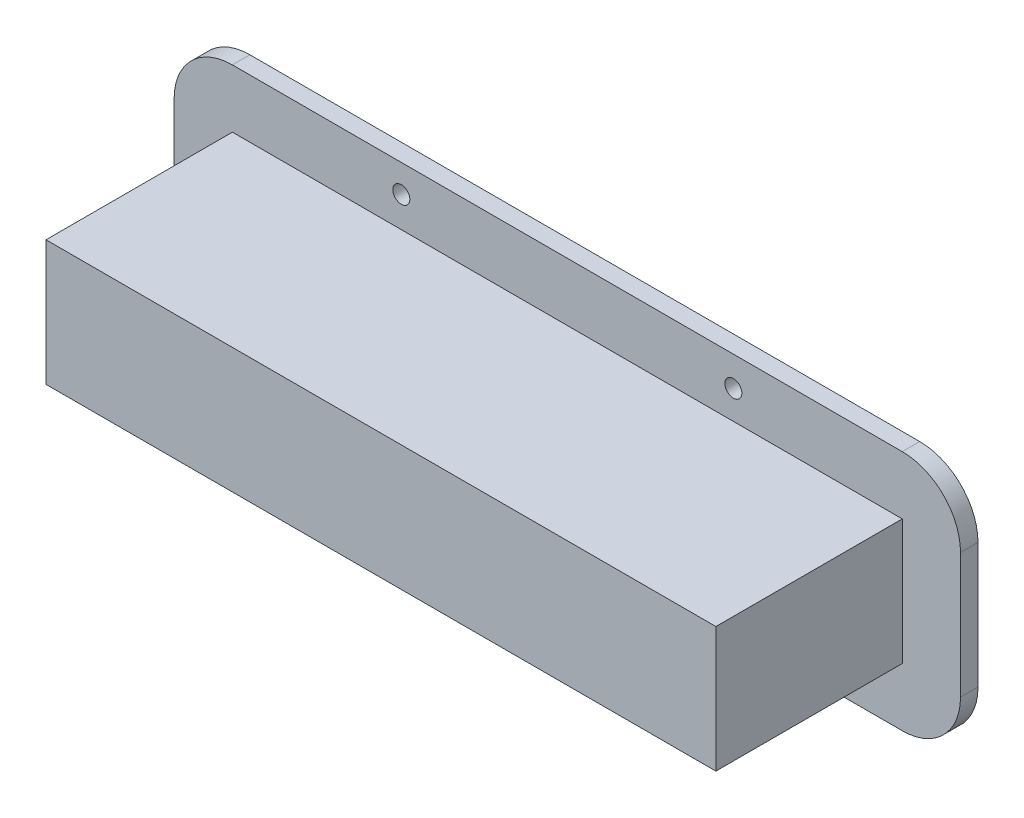
ISO-10303-21;
HEADER;
FILE_DESCRIPTION(('STEP AP214'),'2;1');
FILE_NAME('part.step','',(''),(''),'','','');
FILE_SCHEMA(('AUTOMOTIVE_DESIGN { 1 0 10303 214 1 1 1 1 }'));
ENDSEC;
DATA;
#1=APPLICATION_CONTEXT('core data for automotive mechanical design processes');
#2=APPLICATION_PROTOCOL_DEFINITION('international standard','automotive_design',2000,#1);
#3=PRODUCT_CONTEXT('',#1,'mechanical');
#4=PRODUCT('Part','Part','',(#3));
#5=PRODUCT_RELATED_PRODUCT_CATEGORY('part','',(#4));
#6=PRODUCT_DEFINITION_FORMATION('','',#4);
#7=PRODUCT_DEFINITION_CONTEXT('part definition',#1,'design');
#8=PRODUCT_DEFINITION('design','',#6,#7);
#9=PRODUCT_DEFINITION_SHAPE('','',#8);
#10=(LENGTH_UNIT() NAMED_UNIT(*) SI_UNIT(.MILLI.,.METRE.));
#11=(NAMED_UNIT(*) PLANE_ANGLE_UNIT() SI_UNIT($,.RADIAN.));
#12=(NAMED_UNIT(*) SI_UNIT($,.STERADIAN.) SOLID_ANGLE_UNIT());
#13=UNCERTAINTY_MEASURE_WITH_UNIT(LENGTH_MEASURE(1.E-05),#10,'distance_accuracy_value','');
#14=(GEOMETRIC_REPRESENTATION_CONTEXT(3) GLOBAL_UNCERTAINTY_ASSIGNED_CONTEXT((#13)) GLOBAL_UNIT_ASSIGNED_CONTEXT((#10,
#11,#12)) REPRESENTATION_CONTEXT('',''));
#15=CARTESIAN_POINT('',(0.,0.,0.));
#16=DIRECTION('',(0.,0.,1.));
#17=DIRECTION('',(1.,0.,0.));
#18=AXIS2_PLACEMENT_3D('',#15,#16,#17);
#19=CARTESIAN_POINT('',(0.,0.,0.));
#20=DIRECTION('',(0.,0.,1.));
#21=DIRECTION('',(1.,0.,0.));
#22=AXIS2_PLACEMENT_3D('',#19,#20,#21);
#23=PLANE('',#22);
#24=CARTESIAN_POINT('',(38.2852771272443,-16.6646338797814,0.));
#25=DIRECTION('',(0.,0.,1.));
#26=DIRECTION('',(1.,0.,0.));
#27=AXIS2_PLACEMENT_3D('',#24,#25,#26);
#28=CIRCLE('',#27,1.46);
#29=CARTESIAN_POINT('',(39.7452771272443,-16.6646338797814,0.));
#30=VERTEX_POINT('',#29);
#31=EDGE_CURVE('E185',#30,#30,#28,.T.);
#32=ORIENTED_EDGE('',*,*,#31,.T.);
#33=EDGE_LOOP('',(#32));
#34=FACE_BOUND('',#33,.T.);
#35=CARTESIAN_POINT('',(-18.7147228727557,-16.3426338797814,0.));
#36=DIRECTION('',(0.,0.,1.));
#37=DIRECTION('',(1.,0.,0.));
#38=AXIS2_PLACEMENT_3D('',#35,#36,#37);
#39=CIRCLE('',#38,1.46);
#40=CARTESIAN_POINT('',(-17.2547228727557,-16.3426338797814,0.));
#41=VERTEX_POINT('',#40);
#42=EDGE_CURVE('E188',#41,#41,#39,.T.);
#43=ORIENTED_EDGE('',*,*,#42,.T.);
#44=EDGE_LOOP('',(#43));
#45=FACE_BOUND('',#44,.T.);
#46=CARTESIAN_POINT('',(-18.7147228727557,15.0073661202186,0.));
#47=DIRECTION('',(0.,0.,1.));
#48=DIRECTION('',(1.,0.,0.));
#49=AXIS2_PLACEMENT_3D('',#46,#47,#48);
#50=CIRCLE('',#49,1.46);
#51=CARTESIAN_POINT('',(-17.2547228727557,15.0073661202186,0.));
#52=VERTEX_POINT('',#51);
#53=EDGE_CURVE('E193',#52,#52,#50,.T.);
#54=ORIENTED_EDGE('',*,*,#53,.T.);
#55=EDGE_LOOP('',(#54));
#56=FACE_BOUND('',#55,.T.);
#57=CARTESIAN_POINT('',(38.2852771272443,14.6853661202186,0.));
#58=DIRECTION('',(0.,0.,1.));
#59=DIRECTION('',(1.,0.,0.));
#60=AXIS2_PLACEMENT_3D('',#57,#58,#59);
#61=CIRCLE('',#60,1.46);
#62=CARTESIAN_POINT('',(39.7452771272443,14.6853661202186,0.));
#63=VERTEX_POINT('',#62);
#64=EDGE_CURVE('E196',#63,#63,#61,.T.);
#65=ORIENTED_EDGE('',*,*,#64,.T.);
#66=EDGE_LOOP('',(#65));
#67=FACE_BOUND('',#66,.T.);
#68=CARTESIAN_POINT('',(-47.7147228727557,9.77136612021859,0.));
#69=DIRECTION('',(0.,0.,1.));
#70=DIRECTION('',(1.,0.,0.));
#71=AXIS2_PLACEMENT_3D('',#68,#69,#70);
#72=CIRCLE('',#71,10.);
#73=CARTESIAN_POINT('',(-47.7147228727556,19.7713661202186,0.));
#74=VERTEX_POINT('',#73);
#75=CARTESIAN_POINT('',(-57.7147228727557,9.77136612021852,0.));
#76=VERTEX_POINT('',#75);
#77=EDGE_CURVE('E234',#74,#76,#72,.T.);
#78=ORIENTED_EDGE('',*,*,#77,.F.);
#79=DIRECTION('',(-1.,0.,0.));
#80=VECTOR('',#79,1.);
#81=CARTESIAN_POINT('',(-47.7147228727556,19.7713661202186,0.));
#82=LINE('',#81,#80);
#83=CARTESIAN_POINT('',(67.2852771272443,19.7713661202186,0.));
#84=VERTEX_POINT('',#83);
#85=EDGE_CURVE('E239',#84,#74,#82,.T.);
#86=ORIENTED_EDGE('',*,*,#85,.F.);
#87=CARTESIAN_POINT('',(67.2852771272443,9.77136612021859,0.));
#88=DIRECTION('',(0.,0.,1.));
#89=DIRECTION('',(-1.,0.,0.));
#90=AXIS2_PLACEMENT_3D('',#87,#88,#89);
#91=CIRCLE('',#90,10.);
#92=CARTESIAN_POINT('',(77.2852771272443,9.77136612021852,0.));
#93=VERTEX_POINT('',#92);
#94=EDGE_CURVE('E266',#93,#84,#91,.T.);
#95=ORIENTED_EDGE('',*,*,#94,.F.);
#96=DIRECTION('',(0.,1.,0.));
#97=VECTOR('',#96,1.);
#98=CARTESIAN_POINT('',(77.2852771272443,9.77136612021852,0.));
#99=LINE('',#98,#97);
#100=CARTESIAN_POINT('',(77.2852771272444,-11.7286338797813,0.));
#101=VERTEX_POINT('',#100);
#102=EDGE_CURVE('E264',#101,#93,#99,.T.);
#103=ORIENTED_EDGE('',*,*,#102,.F.);
#104=CARTESIAN_POINT('',(67.2852771272443,-11.7286338797814,0.));
#105=DIRECTION('',(0.,0.,1.));
#106=DIRECTION('',(-1.,0.,0.));
#107=AXIS2_PLACEMENT_3D('',#104,#105,#106);
#108=CIRCLE('',#107,10.);
#109=CARTESIAN_POINT('',(67.2852771272443,-21.7286338797814,0.));
#110=VERTEX_POINT('',#109);
#111=EDGE_CURVE('E262',#110,#101,#108,.T.);
#112=ORIENTED_EDGE('',*,*,#111,.F.);
#113=DIRECTION('',(1.,0.,0.));
#114=VECTOR('',#113,1.);
#115=CARTESIAN_POINT('',(-47.7147228727556,-21.7286338797814,0.));
#116=LINE('',#115,#114);
#117=CARTESIAN_POINT('',(-47.7147228727556,-21.7286338797814,0.));
#118=VERTEX_POINT('',#117);
#119=EDGE_CURVE('E260',#118,#110,#116,.T.);
#120=ORIENTED_EDGE('',*,*,#119,.F.);
#121=CARTESIAN_POINT('',(-47.7147228727557,-11.7286338797814,0.));
#122=DIRECTION('',(0.,0.,1.));
#123=DIRECTION('',(1.,0.,0.));
#124=AXIS2_PLACEMENT_3D('',#121,#122,#123);
#125=CIRCLE('',#124,10.);
#126=CARTESIAN_POINT('',(-57.7147228727557,-11.7286338797813,0.));
#127=VERTEX_POINT('',#126);
#128=EDGE_CURVE('E258',#127,#118,#125,.T.);
#129=ORIENTED_EDGE('',*,*,#128,.F.);
#130=DIRECTION('',(0.,-1.,0.));
#131=VECTOR('',#130,1.);
#132=CARTESIAN_POINT('',(-57.7147228727557,9.77136612021852,0.));
#133=LINE('',#132,#131);
#134=EDGE_CURVE('E256',#76,#127,#133,.T.);
#135=ORIENTED_EDGE('',*,*,#134,.F.);
#136=EDGE_LOOP('',(#78,#86,#95,#103,#112,#120,#129,#135));
#137=FACE_BOUND('',#136,.T.);
#138=DIRECTION('',(0.,1.,0.));
#139=VECTOR('',#138,1.);
#140=CARTESIAN_POINT('',(62.2852771272444,4.77136612021859,0.));
#141=LINE('',#140,#139);
#142=CARTESIAN_POINT('',(62.2852771272444,-6.72863387978141,0.));
#143=VERTEX_POINT('',#142);
#144=CARTESIAN_POINT('',(62.2852771272444,4.77136612021859,0.));
#145=VERTEX_POINT('',#144);
#146=EDGE_CURVE('E213',#143,#145,#141,.T.);
#147=ORIENTED_EDGE('',*,*,#146,.T.);
#148=DIRECTION('',(-1.,0.,0.));
#149=VECTOR('',#148,1.);
#150=CARTESIAN_POINT('',(62.2852771272444,4.77136612021859,0.));
#151=LINE('',#150,#149);
#152=CARTESIAN_POINT('',(-42.7147228727556,4.77136612021858,0.));
#153=VERTEX_POINT('',#152);
#154=EDGE_CURVE('E216',#145,#153,#151,.T.);
#155=ORIENTED_EDGE('',*,*,#154,.T.);
#156=DIRECTION('',(0.,-1.,0.));
#157=VECTOR('',#156,1.);
#158=CARTESIAN_POINT('',(-42.7147228727556,4.77136612021858,0.));
#159=LINE('',#158,#157);
#160=CARTESIAN_POINT('',(-42.7147228727556,-6.72863387978142,0.));
#161=VERTEX_POINT('',#160);
#162=EDGE_CURVE('E220',#153,#161,#159,.T.);
#163=ORIENTED_EDGE('',*,*,#162,.T.);
#164=DIRECTION('',(1.,0.,0.));
#165=VECTOR('',#164,1.);
#166=CARTESIAN_POINT('',(62.2852771272444,-6.72863387978141,0.));
#167=LINE('',#166,#165);
#168=EDGE_CURVE('E206',#161,#143,#167,.T.);
#169=ORIENTED_EDGE('',*,*,#168,.T.);
#170=EDGE_LOOP('',(#147,#155,#163,#169));
#171=FACE_BOUND('',#170,.T.);
#172=ADVANCED_FACE('F33',(#34,#45,#56,#67,#137,#171),#23,.F.);
#173=CARTESIAN_POINT('',(-47.7147228727557,9.77136612021859,35.));
#174=DIRECTION('',(1.,0.,0.));
#175=DIRECTION('',(0.,0.,-1.));
#176=AXIS2_PLACEMENT_3D('',#173,#174,#175);
#177=PLANE('',#176);
#178=DIRECTION('',(0.,0.,-1.));
#179=VECTOR('',#178,1.);
#180=CARTESIAN_POINT('',(-47.7147228727557,-5.22863387978141,35.));
#181=LINE('',#180,#179);
#182=CARTESIAN_POINT('',(-47.7147228727557,-5.22863387978141,26.5));
#183=VERTEX_POINT('',#182);
#184=CARTESIAN_POINT('',(-47.7147228727557,-5.22863387978141,11.5));
#185=VERTEX_POINT('',#184);
#186=EDGE_CURVE('E184',#183,#185,#181,.T.);
#187=ORIENTED_EDGE('',*,*,#186,.T.);
#188=DIRECTION('',(0.,1.,0.));
#189=VECTOR('',#188,1.);
#190=CARTESIAN_POINT('',(-47.7147228727557,9.77136612021859,11.5));
#191=LINE('',#190,#189);
#192=CARTESIAN_POINT('',(-47.7147228727557,3.27136612021859,11.5));
#193=VERTEX_POINT('',#192);
#194=EDGE_CURVE('E177',#185,#193,#191,.T.);
#195=ORIENTED_EDGE('',*,*,#194,.T.);
#196=DIRECTION('',(0.,0.,1.));
#197=VECTOR('',#196,1.);
#198=CARTESIAN_POINT('',(-47.7147228727557,3.27136612021859,35.));
#199=LINE('',#198,#197);
#200=CARTESIAN_POINT('',(-47.7147228727557,3.27136612021859,26.5));
#201=VERTEX_POINT('',#200);
#202=EDGE_CURVE('E166',#193,#201,#199,.T.);
#203=ORIENTED_EDGE('',*,*,#202,.T.);
#204=DIRECTION('',(0.,-1.,0.));
#205=VECTOR('',#204,1.);
#206=CARTESIAN_POINT('',(-47.7147228727557,9.77136612021859,26.5));
#207=LINE('',#206,#205);
#208=EDGE_CURVE('E171',#201,#183,#207,.T.);
#209=ORIENTED_EDGE('',*,*,#208,.T.);
#210=EDGE_LOOP('',(#187,#195,#203,#209));
#211=FACE_BOUND('',#210,.T.);
#212=DIRECTION('',(0.,0.,-1.));
#213=VECTOR('',#212,1.);
#214=CARTESIAN_POINT('',(-47.7147228727557,9.77136612021859,35.));
#215=LINE('',#214,#213);
#216=CARTESIAN_POINT('',(-47.7147228727557,9.77136612021859,35.));
#217=VERTEX_POINT('',#216);
#218=CARTESIAN_POINT('',(-47.7147228727557,9.77136612021859,3.));
#219=VERTEX_POINT('',#218);
#220=EDGE_CURVE('E310',#217,#219,#215,.T.);
#221=ORIENTED_EDGE('',*,*,#220,.T.);
#222=DIRECTION('',(0.,-1.,0.));
#223=VECTOR('',#222,1.);
#224=CARTESIAN_POINT('',(-47.7147228727557,9.77136612021859,3.));
#225=LINE('',#224,#223);
#226=CARTESIAN_POINT('',(-47.7147228727557,-11.7286338797814,3.));
#227=VERTEX_POINT('',#226);
#228=EDGE_CURVE('E298',#219,#227,#225,.T.);
#229=ORIENTED_EDGE('',*,*,#228,.T.);
#230=DIRECTION('',(0.,0.,-1.));
#231=VECTOR('',#230,1.);
#232=CARTESIAN_POINT('',(-47.7147228727557,-11.7286338797814,35.));
#233=LINE('',#232,#231);
#234=CARTESIAN_POINT('',(-47.7147228727557,-11.7286338797814,35.));
#235=VERTEX_POINT('',#234);
#236=EDGE_CURVE('E319',#235,#227,#233,.T.);
#237=ORIENTED_EDGE('',*,*,#236,.F.);
#238=DIRECTION('',(0.,-1.,0.));
#239=VECTOR('',#238,1.);
#240=CARTESIAN_POINT('',(-47.7147228727557,9.77136612021859,35.));
#241=LINE('',#240,#239);
#242=EDGE_CURVE('E301',#217,#235,#241,.T.);
#243=ORIENTED_EDGE('',*,*,#242,.F.);
#244=EDGE_LOOP('',(#221,#229,#237,#243));
#245=FACE_BOUND('',#244,.T.);
#246=ADVANCED_FACE('F35',(#211,#245),#177,.F.);
#247=CARTESIAN_POINT('',(-47.7147228727557,-11.7286338797814,35.));
#248=DIRECTION('',(0.,1.,0.));
#249=DIRECTION('',(0.,0.,1.));
#250=AXIS2_PLACEMENT_3D('',#247,#248,#249);
#251=PLANE('',#250);
#252=ORIENTED_EDGE('',*,*,#236,.T.);
#253=DIRECTION('',(1.,0.,0.));
#254=VECTOR('',#253,1.);
#255=CARTESIAN_POINT('',(-47.7147228727557,-11.7286338797814,3.));
#256=LINE('',#255,#254);
#257=CARTESIAN_POINT('',(67.2852771272443,-11.7286338797814,3.));
#258=VERTEX_POINT('',#257);
#259=EDGE_CURVE('E295',#227,#258,#256,.T.);
#260=ORIENTED_EDGE('',*,*,#259,.T.);
#261=DIRECTION('',(0.,0.,-1.));
#262=VECTOR('',#261,1.);
#263=CARTESIAN_POINT('',(67.2852771272443,-11.7286338797814,35.));
#264=LINE('',#263,#262);
#265=CARTESIAN_POINT('',(67.2852771272443,-11.7286338797814,35.));
#266=VERTEX_POINT('',#265);
#267=EDGE_CURVE('E316',#266,#258,#264,.T.);
#268=ORIENTED_EDGE('',*,*,#267,.F.);
#269=DIRECTION('',(1.,0.,0.));
#270=VECTOR('',#269,1.);
#271=CARTESIAN_POINT('',(-47.7147228727557,-11.7286338797814,35.));
#272=LINE('',#271,#270);
#273=EDGE_CURVE('E304',#235,#266,#272,.T.);
#274=ORIENTED_EDGE('',*,*,#273,.F.);
#275=EDGE_LOOP('',(#252,#260,#268,#274));
#276=FACE_BOUND('',#275,.T.);
#277=ADVANCED_FACE('F367',(#276),#251,.F.);
#278=CARTESIAN_POINT('',(67.2852771272443,9.77136612021859,35.));
#279=DIRECTION('',(-1.,0.,0.));
#280=DIRECTION('',(0.,0.,1.));
#281=AXIS2_PLACEMENT_3D('',#278,#279,#280);
#282=PLANE('',#281);
#283=ORIENTED_EDGE('',*,*,#267,.T.);
#284=DIRECTION('',(0.,1.,0.));
#285=VECTOR('',#284,1.);
#286=CARTESIAN_POINT('',(67.2852771272443,9.77136612021859,3.));
#287=LINE('',#286,#285);
#288=CARTESIAN_POINT('',(67.2852771272443,9.77136612021859,3.));
#289=VERTEX_POINT('',#288);
#290=EDGE_CURVE('E292',#258,#289,#287,.T.);
#291=ORIENTED_EDGE('',*,*,#290,.T.);
#292=DIRECTION('',(0.,0.,-1.));
#293=VECTOR('',#292,1.);
#294=CARTESIAN_POINT('',(67.2852771272443,9.77136612021859,35.));
#295=LINE('',#294,#293);
#296=CARTESIAN_POINT('',(67.2852771272443,9.77136612021859,35.));
#297=VERTEX_POINT('',#296);
#298=EDGE_CURVE('E313',#297,#289,#295,.T.);
#299=ORIENTED_EDGE('',*,*,#298,.F.);
#300=DIRECTION('',(0.,1.,0.));
#301=VECTOR('',#300,1.);
#302=CARTESIAN_POINT('',(67.2852771272443,9.77136612021859,35.));
#303=LINE('',#302,#301);
#304=EDGE_CURVE('E306',#266,#297,#303,.T.);
#305=ORIENTED_EDGE('',*,*,#304,.F.);
#306=EDGE_LOOP('',(#283,#291,#299,#305));
#307=FACE_BOUND('',#306,.T.);
#308=ADVANCED_FACE('F376',(#307),#282,.F.);
#309=CARTESIAN_POINT('',(-47.7147228727557,9.77136612021859,35.));
#310=DIRECTION('',(0.,-1.,0.));
#311=DIRECTION('',(0.,0.,-1.));
#312=AXIS2_PLACEMENT_3D('',#309,#310,#311);
#313=PLANE('',#312);
#314=ORIENTED_EDGE('',*,*,#298,.T.);
#315=DIRECTION('',(-1.,0.,0.));
#316=VECTOR('',#315,1.);
#317=CARTESIAN_POINT('',(-47.7147228727557,9.77136612021859,3.));
#318=LINE('',#317,#316);
#319=EDGE_CURVE('E322',#289,#219,#318,.T.);
#320=ORIENTED_EDGE('',*,*,#319,.T.);
#321=ORIENTED_EDGE('',*,*,#220,.F.);
#322=DIRECTION('',(-1.,0.,0.));
#323=VECTOR('',#322,1.);
#324=CARTESIAN_POINT('',(-47.7147228727557,9.77136612021859,35.));
#325=LINE('',#324,#323);
#326=EDGE_CURVE('E308',#297,#217,#325,.T.);
#327=ORIENTED_EDGE('',*,*,#326,.F.);
#328=EDGE_LOOP('',(#314,#320,#321,#327));
#329=FACE_BOUND('',#328,.T.);
#330=ADVANCED_FACE('F373',(#329),#313,.F.);
#331=CARTESIAN_POINT('',(0.,0.,35.));
#332=DIRECTION('',(0.,0.,1.));
#333=DIRECTION('',(1.,0.,0.));
#334=AXIS2_PLACEMENT_3D('',#331,#332,#333);
#335=PLANE('',#334);
#336=ORIENTED_EDGE('',*,*,#242,.T.);
#337=ORIENTED_EDGE('',*,*,#273,.T.);
#338=ORIENTED_EDGE('',*,*,#304,.T.);
#339=ORIENTED_EDGE('',*,*,#326,.T.);
#340=EDGE_LOOP('',(#336,#337,#338,#339));
#341=FACE_BOUND('',#340,.T.);
#342=ADVANCED_FACE('F371',(#341),#335,.T.);
#343=CARTESIAN_POINT('',(-47.7147228727557,9.77136612021859,3.));
#344=DIRECTION('',(0.,0.,1.));
#345=DIRECTION('',(1.,0.,0.));
#346=AXIS2_PLACEMENT_3D('',#343,#344,#345);
#347=PLANE('',#346);
#348=CARTESIAN_POINT('',(38.2852771272443,-16.6646338797814,3.));
#349=DIRECTION('',(0.,0.,1.));
#350=DIRECTION('',(1.,0.,0.));
#351=AXIS2_PLACEMENT_3D('',#348,#349,#350);
#352=CIRCLE('',#351,1.46);
#353=CARTESIAN_POINT('',(39.7452771272443,-16.6646338797814,3.));
#354=VERTEX_POINT('',#353);
#355=EDGE_CURVE('E217',#354,#354,#352,.F.);
#356=ORIENTED_EDGE('',*,*,#355,.T.);
#357=EDGE_LOOP('',(#356));
#358=FACE_BOUND('',#357,.T.);
#359=CARTESIAN_POINT('',(-18.7147228727557,-16.3426338797814,3.));
#360=DIRECTION('',(0.,0.,1.));
#361=DIRECTION('',(1.,0.,0.));
#362=AXIS2_PLACEMENT_3D('',#359,#360,#361);
#363=CIRCLE('',#362,1.46);
#364=CARTESIAN_POINT('',(-17.2547228727557,-16.3426338797814,3.));
#365=VERTEX_POINT('',#364);
#366=EDGE_CURVE('E331',#365,#365,#363,.F.);
#367=ORIENTED_EDGE('',*,*,#366,.T.);
#368=EDGE_LOOP('',(#367));
#369=FACE_BOUND('',#368,.T.);
#370=CARTESIAN_POINT('',(-18.7147228727557,15.0073661202186,3.));
#371=DIRECTION('',(0.,0.,1.));
#372=DIRECTION('',(1.,0.,0.));
#373=AXIS2_PLACEMENT_3D('',#370,#371,#372);
#374=CIRCLE('',#373,1.46);
#375=CARTESIAN_POINT('',(-17.2547228727557,15.0073661202186,3.));
#376=VERTEX_POINT('',#375);
#377=EDGE_CURVE('E328',#376,#376,#374,.F.);
#378=ORIENTED_EDGE('',*,*,#377,.T.);
#379=EDGE_LOOP('',(#378));
#380=FACE_BOUND('',#379,.T.);
#381=CARTESIAN_POINT('',(38.2852771272443,14.6853661202186,3.));
#382=DIRECTION('',(0.,0.,1.));
#383=DIRECTION('',(1.,0.,0.));
#384=AXIS2_PLACEMENT_3D('',#381,#382,#383);
#385=CIRCLE('',#384,1.46);
#386=CARTESIAN_POINT('',(39.7452771272443,14.6853661202186,3.));
#387=VERTEX_POINT('',#386);
#388=EDGE_CURVE('E201',#387,#387,#385,.F.);
#389=ORIENTED_EDGE('',*,*,#388,.T.);
#390=EDGE_LOOP('',(#389));
#391=FACE_BOUND('',#390,.T.);
#392=CARTESIAN_POINT('',(-47.7147228727557,9.77136612021859,3.));
#393=DIRECTION('',(0.,0.,1.));
#394=DIRECTION('',(1.,0.,0.));
#395=AXIS2_PLACEMENT_3D('',#392,#393,#394);
#396=CIRCLE('',#395,10.);
#397=CARTESIAN_POINT('',(-47.7147228727556,19.7713661202186,3.));
#398=VERTEX_POINT('',#397);
#399=CARTESIAN_POINT('',(-57.7147228727557,9.77136612021852,3.));
#400=VERTEX_POINT('',#399);
#401=EDGE_CURVE('E235',#398,#400,#396,.T.);
#402=ORIENTED_EDGE('',*,*,#401,.T.);
#403=DIRECTION('',(0.,-1.,0.));
#404=VECTOR('',#403,1.);
#405=CARTESIAN_POINT('',(-57.7147228727557,9.77136612021852,3.));
#406=LINE('',#405,#404);
#407=CARTESIAN_POINT('',(-57.7147228727557,-11.7286338797813,3.));
#408=VERTEX_POINT('',#407);
#409=EDGE_CURVE('E238',#400,#408,#406,.T.);
#410=ORIENTED_EDGE('',*,*,#409,.T.);
#411=CARTESIAN_POINT('',(-47.7147228727557,-11.7286338797814,3.));
#412=DIRECTION('',(0.,0.,1.));
#413=DIRECTION('',(1.,0.,0.));
#414=AXIS2_PLACEMENT_3D('',#411,#412,#413);
#415=CIRCLE('',#414,10.);
#416=CARTESIAN_POINT('',(-47.7147228727556,-21.7286338797814,3.));
#417=VERTEX_POINT('',#416);
#418=EDGE_CURVE('E241',#408,#417,#415,.T.);
#419=ORIENTED_EDGE('',*,*,#418,.T.);
#420=DIRECTION('',(1.,0.,0.));
#421=VECTOR('',#420,1.);
#422=CARTESIAN_POINT('',(-47.7147228727556,-21.7286338797814,3.));
#423=LINE('',#422,#421);
#424=CARTESIAN_POINT('',(67.2852771272443,-21.7286338797814,3.));
#425=VERTEX_POINT('',#424);
#426=EDGE_CURVE('E243',#417,#425,#423,.T.);
#427=ORIENTED_EDGE('',*,*,#426,.T.);
#428=CARTESIAN_POINT('',(67.2852771272443,-11.7286338797814,3.));
#429=DIRECTION('',(0.,0.,1.));
#430=DIRECTION('',(-1.,0.,0.));
#431=AXIS2_PLACEMENT_3D('',#428,#429,#430);
#432=CIRCLE('',#431,10.);
#433=CARTESIAN_POINT('',(77.2852771272444,-11.7286338797813,3.));
#434=VERTEX_POINT('',#433);
#435=EDGE_CURVE('E245',#425,#434,#432,.T.);
#436=ORIENTED_EDGE('',*,*,#435,.T.);
#437=DIRECTION('',(0.,1.,0.));
#438=VECTOR('',#437,1.);
#439=CARTESIAN_POINT('',(77.2852771272443,9.77136612021852,3.));
#440=LINE('',#439,#438);
#441=CARTESIAN_POINT('',(77.2852771272443,9.77136612021852,3.));
#442=VERTEX_POINT('',#441);
#443=EDGE_CURVE('E247',#434,#442,#440,.T.);
#444=ORIENTED_EDGE('',*,*,#443,.T.);
#445=CARTESIAN_POINT('',(67.2852771272443,9.77136612021859,3.));
#446=DIRECTION('',(0.,0.,1.));
#447=DIRECTION('',(-1.,0.,0.));
#448=AXIS2_PLACEMENT_3D('',#445,#446,#447);
#449=CIRCLE('',#448,10.);
#450=CARTESIAN_POINT('',(67.2852771272443,19.7713661202186,3.));
#451=VERTEX_POINT('',#450);
#452=EDGE_CURVE('E249',#442,#451,#449,.T.);
#453=ORIENTED_EDGE('',*,*,#452,.T.);
#454=DIRECTION('',(-1.,0.,0.));
#455=VECTOR('',#454,1.);
#456=CARTESIAN_POINT('',(-47.7147228727556,19.7713661202186,3.));
#457=LINE('',#456,#455);
#458=EDGE_CURVE('E251',#451,#398,#457,.T.);
#459=ORIENTED_EDGE('',*,*,#458,.T.);
#460=EDGE_LOOP('',(#402,#410,#419,#427,#436,#444,#453,#459));
#461=FACE_BOUND('',#460,.T.);
#462=ORIENTED_EDGE('',*,*,#228,.F.);
#463=ORIENTED_EDGE('',*,*,#319,.F.);
#464=ORIENTED_EDGE('',*,*,#290,.F.);
#465=ORIENTED_EDGE('',*,*,#259,.F.);
#466=EDGE_LOOP('',(#462,#463,#464,#465));
#467=FACE_BOUND('',#466,.T.);
#468=ADVANCED_FACE('F389',(#358,#369,#380,#391,#461,#467),#347,.T.);
#469=CARTESIAN_POINT('',(-47.7147228727557,9.77136612021859,3.));
#470=DIRECTION('',(0.,0.,-1.));
#471=DIRECTION('',(-1.,0.,0.));
#472=AXIS2_PLACEMENT_3D('',#469,#470,#471);
#473=CYLINDRICAL_SURFACE('',#472,10.);
#474=ORIENTED_EDGE('',*,*,#77,.T.);
#475=DIRECTION('',(0.,0.,-1.));
#476=VECTOR('',#475,1.);
#477=CARTESIAN_POINT('',(-57.7147228727557,9.77136612021852,3.));
#478=LINE('',#477,#476);
#479=EDGE_CURVE('E289',#400,#76,#478,.T.);
#480=ORIENTED_EDGE('',*,*,#479,.F.);
#481=ORIENTED_EDGE('',*,*,#401,.F.);
#482=DIRECTION('',(0.,0.,-1.));
#483=VECTOR('',#482,1.);
#484=CARTESIAN_POINT('',(-47.7147228727556,19.7713661202186,3.));
#485=LINE('',#484,#483);
#486=EDGE_CURVE('E253',#398,#74,#485,.T.);
#487=ORIENTED_EDGE('',*,*,#486,.T.);
#488=EDGE_LOOP('',(#474,#480,#481,#487));
#489=FACE_BOUND('',#488,.T.);
#490=ADVANCED_FACE('F398',(#489),#473,.T.);
#491=CARTESIAN_POINT('',(-57.7147228727557,9.77136612021852,3.));
#492=DIRECTION('',(1.,0.,0.));
#493=DIRECTION('',(0.,1.,0.));
#494=AXIS2_PLACEMENT_3D('',#491,#492,#493);
#495=PLANE('',#494);
#496=ORIENTED_EDGE('',*,*,#134,.T.);
#497=DIRECTION('',(0.,0.,-1.));
#498=VECTOR('',#497,1.);
#499=CARTESIAN_POINT('',(-57.7147228727557,-11.7286338797813,3.));
#500=LINE('',#499,#498);
#501=EDGE_CURVE('E286',#408,#127,#500,.T.);
#502=ORIENTED_EDGE('',*,*,#501,.F.);
#503=ORIENTED_EDGE('',*,*,#409,.F.);
#504=ORIENTED_EDGE('',*,*,#479,.T.);
#505=EDGE_LOOP('',(#496,#502,#503,#504));
#506=FACE_BOUND('',#505,.T.);
#507=ADVANCED_FACE('F404',(#506),#495,.F.);
#508=CARTESIAN_POINT('',(-47.7147228727557,-11.7286338797814,3.));
#509=DIRECTION('',(0.,0.,-1.));
#510=DIRECTION('',(-1.,0.,0.));
#511=AXIS2_PLACEMENT_3D('',#508,#509,#510);
#512=CYLINDRICAL_SURFACE('',#511,10.);
#513=ORIENTED_EDGE('',*,*,#128,.T.);
#514=DIRECTION('',(0.,0.,-1.));
#515=VECTOR('',#514,1.);
#516=CARTESIAN_POINT('',(-47.7147228727556,-21.7286338797814,3.));
#517=LINE('',#516,#515);
#518=EDGE_CURVE('E283',#417,#118,#517,.T.);
#519=ORIENTED_EDGE('',*,*,#518,.F.);
#520=ORIENTED_EDGE('',*,*,#418,.F.);
#521=ORIENTED_EDGE('',*,*,#501,.T.);
#522=EDGE_LOOP('',(#513,#519,#520,#521));
#523=FACE_BOUND('',#522,.T.);
#524=ADVANCED_FACE('F430',(#523),#512,.T.);
#525=CARTESIAN_POINT('',(-47.7147228727556,-21.7286338797814,3.));
#526=DIRECTION('',(0.,1.,0.));
#527=DIRECTION('',(0.,0.,1.));
#528=AXIS2_PLACEMENT_3D('',#525,#526,#527);
#529=PLANE('',#528);
#530=ORIENTED_EDGE('',*,*,#119,.T.);
#531=DIRECTION('',(0.,0.,-1.));
#532=VECTOR('',#531,1.);
#533=CARTESIAN_POINT('',(67.2852771272443,-21.7286338797814,3.));
#534=LINE('',#533,#532);
#535=EDGE_CURVE('E280',#425,#110,#534,.T.);
#536=ORIENTED_EDGE('',*,*,#535,.F.);
#537=ORIENTED_EDGE('',*,*,#426,.F.);
#538=ORIENTED_EDGE('',*,*,#518,.T.);
#539=EDGE_LOOP('',(#530,#536,#537,#538));
#540=FACE_BOUND('',#539,.T.);
#541=ADVANCED_FACE('F426',(#540),#529,.F.);
#542=CARTESIAN_POINT('',(67.2852771272443,-11.7286338797814,3.));
#543=DIRECTION('',(0.,0.,-1.));
#544=DIRECTION('',(-1.,0.,0.));
#545=AXIS2_PLACEMENT_3D('',#542,#543,#544);
#546=CYLINDRICAL_SURFACE('',#545,10.);
#547=ORIENTED_EDGE('',*,*,#111,.T.);
#548=DIRECTION('',(0.,0.,-1.));
#549=VECTOR('',#548,1.);
#550=CARTESIAN_POINT('',(77.2852771272444,-11.7286338797813,3.));
#551=LINE('',#550,#549);
#552=EDGE_CURVE('E277',#434,#101,#551,.T.);
#553=ORIENTED_EDGE('',*,*,#552,.F.);
#554=ORIENTED_EDGE('',*,*,#435,.F.);
#555=ORIENTED_EDGE('',*,*,#535,.T.);
#556=EDGE_LOOP('',(#547,#553,#554,#555));
#557=FACE_BOUND('',#556,.T.);
#558=ADVANCED_FACE('F422',(#557),#546,.T.);
#559=CARTESIAN_POINT('',(77.2852771272443,9.77136612021852,3.));
#560=DIRECTION('',(-1.,0.,0.));
#561=DIRECTION('',(0.,-1.,0.));
#562=AXIS2_PLACEMENT_3D('',#559,#560,#561);
#563=PLANE('',#562);
#564=ORIENTED_EDGE('',*,*,#102,.T.);
#565=DIRECTION('',(0.,0.,-1.));
#566=VECTOR('',#565,1.);
#567=CARTESIAN_POINT('',(77.2852771272443,9.77136612021852,3.));
#568=LINE('',#567,#566);
#569=EDGE_CURVE('E274',#442,#93,#568,.T.);
#570=ORIENTED_EDGE('',*,*,#569,.F.);
#571=ORIENTED_EDGE('',*,*,#443,.F.);
#572=ORIENTED_EDGE('',*,*,#552,.T.);
#573=EDGE_LOOP('',(#564,#570,#571,#572));
#574=FACE_BOUND('',#573,.T.);
#575=ADVANCED_FACE('F418',(#574),#563,.F.);
#576=CARTESIAN_POINT('',(67.2852771272443,9.77136612021859,3.));
#577=DIRECTION('',(0.,0.,-1.));
#578=DIRECTION('',(-1.,0.,0.));
#579=AXIS2_PLACEMENT_3D('',#576,#577,#578);
#580=CYLINDRICAL_SURFACE('',#579,10.);
#581=ORIENTED_EDGE('',*,*,#94,.T.);
#582=DIRECTION('',(0.,0.,-1.));
#583=VECTOR('',#582,1.);
#584=CARTESIAN_POINT('',(67.2852771272443,19.7713661202186,3.));
#585=LINE('',#584,#583);
#586=EDGE_CURVE('E271',#451,#84,#585,.T.);
#587=ORIENTED_EDGE('',*,*,#586,.F.);
#588=ORIENTED_EDGE('',*,*,#452,.F.);
#589=ORIENTED_EDGE('',*,*,#569,.T.);
#590=EDGE_LOOP('',(#581,#587,#588,#589));
#591=FACE_BOUND('',#590,.T.);
#592=ADVANCED_FACE('F414',(#591),#580,.T.);
#593=CARTESIAN_POINT('',(-47.7147228727556,19.7713661202186,3.));
#594=DIRECTION('',(0.,-1.,0.));
#595=DIRECTION('',(0.,0.,-1.));
#596=AXIS2_PLACEMENT_3D('',#593,#594,#595);
#597=PLANE('',#596);
#598=ORIENTED_EDGE('',*,*,#85,.T.);
#599=ORIENTED_EDGE('',*,*,#486,.F.);
#600=ORIENTED_EDGE('',*,*,#458,.F.);
#601=ORIENTED_EDGE('',*,*,#586,.T.);
#602=EDGE_LOOP('',(#598,#599,#600,#601));
#603=FACE_BOUND('',#602,.T.);
#604=ADVANCED_FACE('F411',(#603),#597,.F.);
#605=CARTESIAN_POINT('',(62.2852771272444,4.77136612021859,30.));
#606=DIRECTION('',(-1.,0.,0.));
#607=DIRECTION('',(0.,0.,1.));
#608=AXIS2_PLACEMENT_3D('',#605,#606,#607);
#609=PLANE('',#608);
#610=ORIENTED_EDGE('',*,*,#146,.F.);
#611=DIRECTION('',(0.,0.,-1.));
#612=VECTOR('',#611,1.);
#613=CARTESIAN_POINT('',(62.2852771272444,-6.72863387978141,30.));
#614=LINE('',#613,#612);
#615=CARTESIAN_POINT('',(62.2852771272444,-6.72863387978141,30.));
#616=VERTEX_POINT('',#615);
#617=EDGE_CURVE('E212',#616,#143,#614,.T.);
#618=ORIENTED_EDGE('',*,*,#617,.F.);
#619=DIRECTION('',(0.,1.,0.));
#620=VECTOR('',#619,1.);
#621=CARTESIAN_POINT('',(62.2852771272444,4.77136612021859,30.));
#622=LINE('',#621,#620);
#623=CARTESIAN_POINT('',(62.2852771272444,4.77136612021859,30.));
#624=VERTEX_POINT('',#623);
#625=EDGE_CURVE('E202',#616,#624,#622,.T.);
#626=ORIENTED_EDGE('',*,*,#625,.T.);
#627=DIRECTION('',(0.,0.,-1.));
#628=VECTOR('',#627,1.);
#629=CARTESIAN_POINT('',(62.2852771272444,4.77136612021859,30.));
#630=LINE('',#629,#628);
#631=EDGE_CURVE('E231',#624,#145,#630,.T.);
#632=ORIENTED_EDGE('',*,*,#631,.T.);
#633=EDGE_LOOP('',(#610,#618,#626,#632));
#634=FACE_BOUND('',#633,.T.);
#635=ADVANCED_FACE('F409',(#634),#609,.T.);
#636=CARTESIAN_POINT('',(62.2852771272444,4.77136612021859,30.));
#637=DIRECTION('',(0.,-1.,0.));
#638=DIRECTION('',(1.,0.,0.));
#639=AXIS2_PLACEMENT_3D('',#636,#637,#638);
#640=PLANE('',#639);
#641=ORIENTED_EDGE('',*,*,#154,.F.);
#642=ORIENTED_EDGE('',*,*,#631,.F.);
#643=DIRECTION('',(-1.,0.,0.));
#644=VECTOR('',#643,1.);
#645=CARTESIAN_POINT('',(62.2852771272444,4.77136612021859,30.));
#646=LINE('',#645,#644);
#647=CARTESIAN_POINT('',(-42.7147228727556,4.77136612021858,30.));
#648=VERTEX_POINT('',#647);
#649=EDGE_CURVE('E205',#624,#648,#646,.T.);
#650=ORIENTED_EDGE('',*,*,#649,.T.);
#651=DIRECTION('',(0.,0.,-1.));
#652=VECTOR('',#651,1.);
#653=CARTESIAN_POINT('',(-42.7147228727556,4.77136612021858,30.));
#654=LINE('',#653,#652);
#655=EDGE_CURVE('E229',#648,#153,#654,.T.);
#656=ORIENTED_EDGE('',*,*,#655,.T.);
#657=EDGE_LOOP('',(#641,#642,#650,#656));
#658=FACE_BOUND('',#657,.T.);
#659=ADVANCED_FACE('F477',(#658),#640,.T.);
#660=CARTESIAN_POINT('',(-42.7147228727556,4.77136612021858,30.));
#661=DIRECTION('',(1.,0.,0.));
#662=DIRECTION('',(0.,0.,-1.));
#663=AXIS2_PLACEMENT_3D('',#660,#661,#662);
#664=PLANE('',#663);
#665=DIRECTION('',(0.,1.,0.));
#666=VECTOR('',#665,1.);
#667=CARTESIAN_POINT('',(-42.7147228727556,4.77136612021858,11.5));
#668=LINE('',#667,#666);
#669=CARTESIAN_POINT('',(-42.7147228727556,-5.22863387978141,11.5));
#670=VERTEX_POINT('',#669);
#671=CARTESIAN_POINT('',(-42.7147228727556,3.27136612021859,11.5));
#672=VERTEX_POINT('',#671);
#673=EDGE_CURVE('E11',#670,#672,#668,.T.);
#674=ORIENTED_EDGE('',*,*,#673,.F.);
#675=DIRECTION('',(0.,0.,-1.));
#676=VECTOR('',#675,1.);
#677=CARTESIAN_POINT('',(-42.7147228727556,-5.22863387978141,30.));
#678=LINE('',#677,#676);
#679=CARTESIAN_POINT('',(-42.7147228727556,-5.22863387978141,26.5));
#680=VERTEX_POINT('',#679);
#681=EDGE_CURVE('E41',#680,#670,#678,.T.);
#682=ORIENTED_EDGE('',*,*,#681,.F.);
#683=DIRECTION('',(0.,-1.,0.));
#684=VECTOR('',#683,1.);
#685=CARTESIAN_POINT('',(-42.7147228727556,4.77136612021858,26.5));
#686=LINE('',#685,#684);
#687=CARTESIAN_POINT('',(-42.7147228727556,3.27136612021859,26.5));
#688=VERTEX_POINT('',#687);
#689=EDGE_CURVE('E337',#688,#680,#686,.T.);
#690=ORIENTED_EDGE('',*,*,#689,.F.);
#691=DIRECTION('',(0.,0.,1.));
#692=VECTOR('',#691,1.);
#693=CARTESIAN_POINT('',(-42.7147228727556,3.27136612021859,30.));
#694=LINE('',#693,#692);
#695=EDGE_CURVE('E325',#672,#688,#694,.T.);
#696=ORIENTED_EDGE('',*,*,#695,.F.);
#697=EDGE_LOOP('',(#674,#682,#690,#696));
#698=FACE_BOUND('',#697,.T.);
#699=ORIENTED_EDGE('',*,*,#162,.F.);
#700=ORIENTED_EDGE('',*,*,#655,.F.);
#701=DIRECTION('',(0.,-1.,0.));
#702=VECTOR('',#701,1.);
#703=CARTESIAN_POINT('',(-42.7147228727556,4.77136612021858,30.));
#704=LINE('',#703,#702);
#705=CARTESIAN_POINT('',(-42.7147228727556,-6.72863387978142,30.));
#706=VERTEX_POINT('',#705);
#707=EDGE_CURVE('E208',#648,#706,#704,.T.);
#708=ORIENTED_EDGE('',*,*,#707,.T.);
#709=DIRECTION('',(0.,0.,-1.));
#710=VECTOR('',#709,1.);
#711=CARTESIAN_POINT('',(-42.7147228727556,-6.72863387978142,30.));
#712=LINE('',#711,#710);
#713=EDGE_CURVE('E227',#706,#161,#712,.T.);
#714=ORIENTED_EDGE('',*,*,#713,.T.);
#715=EDGE_LOOP('',(#699,#700,#708,#714));
#716=FACE_BOUND('',#715,.T.);
#717=ADVANCED_FACE('F347',(#698,#716),#664,.T.);
#718=CARTESIAN_POINT('',(62.2852771272444,-6.72863387978141,30.));
#719=DIRECTION('',(0.,1.,0.));
#720=DIRECTION('',(-1.,0.,0.));
#721=AXIS2_PLACEMENT_3D('',#718,#719,#720);
#722=PLANE('',#721);
#723=ORIENTED_EDGE('',*,*,#168,.F.);
#724=ORIENTED_EDGE('',*,*,#713,.F.);
#725=DIRECTION('',(1.,0.,0.));
#726=VECTOR('',#725,1.);
#727=CARTESIAN_POINT('',(62.2852771272444,-6.72863387978141,30.));
#728=LINE('',#727,#726);
#729=EDGE_CURVE('E210',#706,#616,#728,.T.);
#730=ORIENTED_EDGE('',*,*,#729,.T.);
#731=ORIENTED_EDGE('',*,*,#617,.T.);
#732=EDGE_LOOP('',(#723,#724,#730,#731));
#733=FACE_BOUND('',#732,.T.);
#734=ADVANCED_FACE('F470',(#733),#722,.T.);
#735=CARTESIAN_POINT('',(0.,0.,30.));
#736=DIRECTION('',(0.,0.,-1.));
#737=DIRECTION('',(-1.,0.,0.));
#738=AXIS2_PLACEMENT_3D('',#735,#736,#737);
#739=PLANE('',#738);
#740=ORIENTED_EDGE('',*,*,#625,.F.);
#741=ORIENTED_EDGE('',*,*,#729,.F.);
#742=ORIENTED_EDGE('',*,*,#707,.F.);
#743=ORIENTED_EDGE('',*,*,#649,.F.);
#744=EDGE_LOOP('',(#740,#741,#742,#743));
#745=FACE_BOUND('',#744,.T.);
#746=ADVANCED_FACE('F475',(#745),#739,.T.);
#747=CARTESIAN_POINT('',(38.2852771272443,14.6853661202186,33.));
#748=DIRECTION('',(0.,0.,-1.));
#749=DIRECTION('',(-1.,0.,0.));
#750=AXIS2_PLACEMENT_3D('',#747,#748,#749);
#751=CYLINDRICAL_SURFACE('',#750,1.46);
#752=ORIENTED_EDGE('',*,*,#388,.F.);
#753=EDGE_LOOP('',(#752));
#754=FACE_BOUND('',#753,.T.);
#755=ORIENTED_EDGE('',*,*,#64,.F.);
#756=EDGE_LOOP('',(#755));
#757=FACE_BOUND('',#756,.T.);
#758=ADVANCED_FACE('F490',(#754,#757),#751,.F.);
#759=CARTESIAN_POINT('',(-18.7147228727557,15.0073661202186,33.));
#760=DIRECTION('',(0.,0.,-1.));
#761=DIRECTION('',(-1.,0.,0.));
#762=AXIS2_PLACEMENT_3D('',#759,#760,#761);
#763=CYLINDRICAL_SURFACE('',#762,1.46);
#764=ORIENTED_EDGE('',*,*,#377,.F.);
#765=EDGE_LOOP('',(#764));
#766=FACE_BOUND('',#765,.T.);
#767=ORIENTED_EDGE('',*,*,#53,.F.);
#768=EDGE_LOOP('',(#767));
#769=FACE_BOUND('',#768,.T.);
#770=ADVANCED_FACE('F493',(#766,#769),#763,.F.);
#771=CARTESIAN_POINT('',(-18.7147228727557,-16.3426338797814,33.));
#772=DIRECTION('',(0.,0.,-1.));
#773=DIRECTION('',(-1.,0.,0.));
#774=AXIS2_PLACEMENT_3D('',#771,#772,#773);
#775=CYLINDRICAL_SURFACE('',#774,1.46);
#776=ORIENTED_EDGE('',*,*,#366,.F.);
#777=EDGE_LOOP('',(#776));
#778=FACE_BOUND('',#777,.T.);
#779=ORIENTED_EDGE('',*,*,#42,.F.);
#780=EDGE_LOOP('',(#779));
#781=FACE_BOUND('',#780,.T.);
#782=ADVANCED_FACE('F498',(#778,#781),#775,.F.);
#783=CARTESIAN_POINT('',(38.2852771272443,-16.6646338797814,33.));
#784=DIRECTION('',(0.,0.,-1.));
#785=DIRECTION('',(-1.,0.,0.));
#786=AXIS2_PLACEMENT_3D('',#783,#784,#785);
#787=CYLINDRICAL_SURFACE('',#786,1.46);
#788=ORIENTED_EDGE('',*,*,#355,.F.);
#789=EDGE_LOOP('',(#788));
#790=FACE_BOUND('',#789,.T.);
#791=ORIENTED_EDGE('',*,*,#31,.F.);
#792=EDGE_LOOP('',(#791));
#793=FACE_BOUND('',#792,.T.);
#794=ADVANCED_FACE('F495',(#790,#793),#787,.F.);
#795=CARTESIAN_POINT('',(-88.0000000000001,3.27136612021859,11.5));
#796=DIRECTION('',(0.,0.,-1.));
#797=DIRECTION('',(0.,1.,0.));
#798=AXIS2_PLACEMENT_3D('',#795,#796,#797);
#799=PLANE('',#798);
#800=DIRECTION('',(1.,0.,0.));
#801=VECTOR('',#800,1.);
#802=CARTESIAN_POINT('',(-88.0000000000001,-5.22863387978141,11.5));
#803=LINE('',#802,#801);
#804=EDGE_CURVE('E172',#185,#670,#803,.T.);
#805=ORIENTED_EDGE('',*,*,#804,.T.);
#806=ORIENTED_EDGE('',*,*,#673,.T.);
#807=DIRECTION('',(1.,0.,0.));
#808=VECTOR('',#807,1.);
#809=CARTESIAN_POINT('',(-88.0000000000001,3.27136612021859,11.5));
#810=LINE('',#809,#808);
#811=EDGE_CURVE('E53',#193,#672,#810,.T.);
#812=ORIENTED_EDGE('',*,*,#811,.F.);
#813=ORIENTED_EDGE('',*,*,#194,.F.);
#814=EDGE_LOOP('',(#805,#806,#812,#813));
#815=FACE_BOUND('',#814,.T.);
#816=ADVANCED_FACE('F176',(#815),#799,.F.);
#817=CARTESIAN_POINT('',(-88.0000000000001,-5.22863387978141,11.5));
#818=DIRECTION('',(0.,-1.,0.));
#819=DIRECTION('',(0.,0.,-1.));
#820=AXIS2_PLACEMENT_3D('',#817,#818,#819);
#821=PLANE('',#820);
#822=DIRECTION('',(1.,0.,0.));
#823=VECTOR('',#822,1.);
#824=CARTESIAN_POINT('',(-88.0000000000001,-5.22863387978141,26.5));
#825=LINE('',#824,#823);
#826=EDGE_CURVE('E343',#183,#680,#825,.T.);
#827=ORIENTED_EDGE('',*,*,#826,.T.);
#828=ORIENTED_EDGE('',*,*,#681,.T.);
#829=ORIENTED_EDGE('',*,*,#804,.F.);
#830=ORIENTED_EDGE('',*,*,#186,.F.);
#831=EDGE_LOOP('',(#827,#828,#829,#830));
#832=FACE_BOUND('',#831,.T.);
#833=ADVANCED_FACE('F341',(#832),#821,.F.);
#834=CARTESIAN_POINT('',(-88.0000000000001,3.27136612021859,26.5));
#835=DIRECTION('',(0.,0.,1.));
#836=DIRECTION('',(1.,0.,0.));
#837=AXIS2_PLACEMENT_3D('',#834,#835,#836);
#838=PLANE('',#837);
#839=DIRECTION('',(1.,0.,0.));
#840=VECTOR('',#839,1.);
#841=CARTESIAN_POINT('',(-88.0000000000001,3.27136612021859,26.5));
#842=LINE('',#841,#840);
#843=EDGE_CURVE('E48',#201,#688,#842,.T.);
#844=ORIENTED_EDGE('',*,*,#843,.T.);
#845=ORIENTED_EDGE('',*,*,#689,.T.);
#846=ORIENTED_EDGE('',*,*,#826,.F.);
#847=ORIENTED_EDGE('',*,*,#208,.F.);
#848=EDGE_LOOP('',(#844,#845,#846,#847));
#849=FACE_BOUND('',#848,.T.);
#850=ADVANCED_FACE('F350',(#849),#838,.F.);
#851=CARTESIAN_POINT('',(-88.0000000000001,3.27136612021859,11.5));
#852=DIRECTION('',(0.,1.,0.));
#853=DIRECTION('',(0.,0.,1.));
#854=AXIS2_PLACEMENT_3D('',#851,#852,#853);
#855=PLANE('',#854);
#856=ORIENTED_EDGE('',*,*,#811,.T.);
#857=ORIENTED_EDGE('',*,*,#695,.T.);
#858=ORIENTED_EDGE('',*,*,#843,.F.);
#859=ORIENTED_EDGE('',*,*,#202,.F.);
#860=EDGE_LOOP('',(#856,#857,#858,#859));
#861=FACE_BOUND('',#860,.T.);
#862=ADVANCED_FACE('F167',(#861),#855,.F.);
#863=CLOSED_SHELL('',(#172,#246,#277,#308,#330,#342,#468,#490,#507,#524,#541,#558,#575,#592,
#604,#635,#659,#717,#734,#746,#758,#770,#782,#794,#816,#833,#850,#862));
#864=MANIFOLD_SOLID_BREP('B2',#863);
#865=ADVANCED_BREP_SHAPE_REPRESENTATION('',(#18,#864),#14);
#866=SHAPE_DEFINITION_REPRESENTATION(#9,#865);
ENDSEC;
END-ISO-10303-21;
